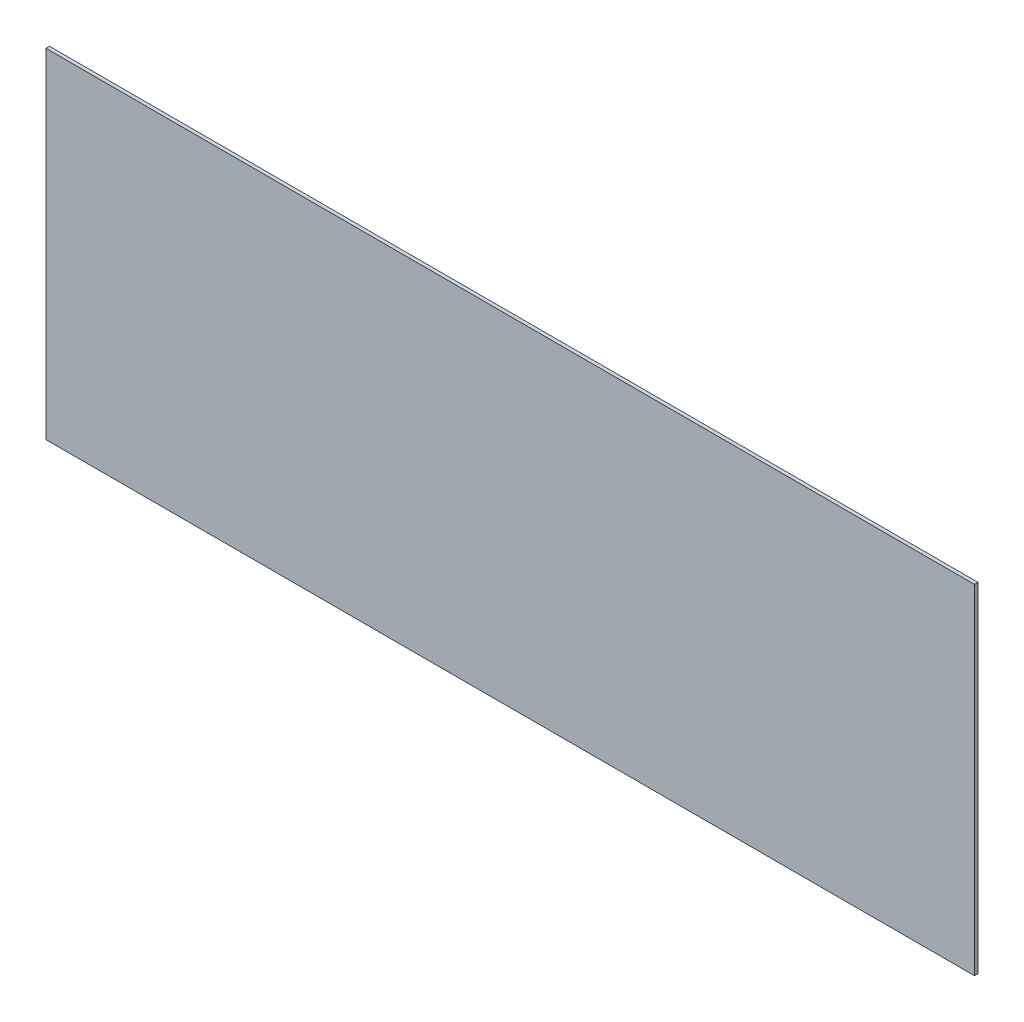
ISO-10303-21;
HEADER;
FILE_DESCRIPTION(('STEP AP214'),'2;1');
FILE_NAME('part.step','',(''),(''),'','','');
FILE_SCHEMA(('AUTOMOTIVE_DESIGN { 1 0 10303 214 1 1 1 1 }'));
ENDSEC;
DATA;
#1=APPLICATION_CONTEXT('core data for automotive mechanical design processes');
#2=APPLICATION_PROTOCOL_DEFINITION('international standard','automotive_design',2000,#1);
#3=PRODUCT_CONTEXT('',#1,'mechanical');
#4=PRODUCT('Part','Part','',(#3));
#5=PRODUCT_RELATED_PRODUCT_CATEGORY('part','',(#4));
#6=PRODUCT_DEFINITION_FORMATION('','',#4);
#7=PRODUCT_DEFINITION_CONTEXT('part definition',#1,'design');
#8=PRODUCT_DEFINITION('design','',#6,#7);
#9=PRODUCT_DEFINITION_SHAPE('','',#8);
#10=(LENGTH_UNIT() NAMED_UNIT(*) SI_UNIT(.MILLI.,.METRE.));
#11=(NAMED_UNIT(*) PLANE_ANGLE_UNIT() SI_UNIT($,.RADIAN.));
#12=(NAMED_UNIT(*) SI_UNIT($,.STERADIAN.) SOLID_ANGLE_UNIT());
#13=UNCERTAINTY_MEASURE_WITH_UNIT(LENGTH_MEASURE(1.E-05),#10,'distance_accuracy_value','');
#14=(GEOMETRIC_REPRESENTATION_CONTEXT(3) GLOBAL_UNCERTAINTY_ASSIGNED_CONTEXT((#13)) GLOBAL_UNIT_ASSIGNED_CONTEXT((#10,
#11,#12)) REPRESENTATION_CONTEXT('',''));
#15=CARTESIAN_POINT('',(0.,0.,0.));
#16=DIRECTION('',(0.,0.,1.));
#17=DIRECTION('',(1.,0.,0.));
#18=AXIS2_PLACEMENT_3D('',#15,#16,#17);
#19=CARTESIAN_POINT('',(-417.5125,-152.4,1.5875));
#20=DIRECTION('',(1.,0.,0.));
#21=DIRECTION('',(0.,1.,0.));
#22=AXIS2_PLACEMENT_3D('',#19,#20,#21);
#23=PLANE('',#22);
#24=DIRECTION('',(0.,-1.,0.));
#25=VECTOR('',#24,1.);
#26=CARTESIAN_POINT('',(-417.5125,-152.4,-1.5875));
#27=LINE('',#26,#25);
#28=CARTESIAN_POINT('',(-417.5125,152.4,-1.5875));
#29=VERTEX_POINT('',#28);
#30=CARTESIAN_POINT('',(-417.5125,-152.4,-1.5875));
#31=VERTEX_POINT('',#30);
#32=EDGE_CURVE('E96',#29,#31,#27,.T.);
#33=ORIENTED_EDGE('',*,*,#32,.T.);
#34=DIRECTION('',(0.,0.,-1.));
#35=VECTOR('',#34,1.);
#36=CARTESIAN_POINT('',(-417.5125,-152.4,1.5875));
#37=LINE('',#36,#35);
#38=CARTESIAN_POINT('',(-417.5125,-152.4,1.5875));
#39=VERTEX_POINT('',#38);
#40=EDGE_CURVE('E11',#39,#31,#37,.T.);
#41=ORIENTED_EDGE('',*,*,#40,.F.);
#42=DIRECTION('',(0.,-1.,0.));
#43=VECTOR('',#42,1.);
#44=CARTESIAN_POINT('',(-417.5125,-152.4,1.5875));
#45=LINE('',#44,#43);
#46=CARTESIAN_POINT('',(-417.5125,152.4,1.5875));
#47=VERTEX_POINT('',#46);
#48=EDGE_CURVE('E84',#47,#39,#45,.T.);
#49=ORIENTED_EDGE('',*,*,#48,.F.);
#50=DIRECTION('',(0.,0.,-1.));
#51=VECTOR('',#50,1.);
#52=CARTESIAN_POINT('',(-417.5125,152.4,1.5875));
#53=LINE('',#52,#51);
#54=EDGE_CURVE('E92',#47,#29,#53,.T.);
#55=ORIENTED_EDGE('',*,*,#54,.T.);
#56=EDGE_LOOP('',(#33,#41,#49,#55));
#57=FACE_BOUND('',#56,.T.);
#58=ADVANCED_FACE('F33',(#57),#23,.F.);
#59=CARTESIAN_POINT('',(417.5125,-152.4,1.5875));
#60=DIRECTION('',(0.,1.,0.));
#61=DIRECTION('',(-1.,0.,0.));
#62=AXIS2_PLACEMENT_3D('',#59,#60,#61);
#63=PLANE('',#62);
#64=DIRECTION('',(1.,0.,0.));
#65=VECTOR('',#64,1.);
#66=CARTESIAN_POINT('',(417.5125,-152.4,-1.5875));
#67=LINE('',#66,#65);
#68=CARTESIAN_POINT('',(417.5125,-152.4,-1.5875));
#69=VERTEX_POINT('',#68);
#70=EDGE_CURVE('E88',#31,#69,#67,.T.);
#71=ORIENTED_EDGE('',*,*,#70,.T.);
#72=DIRECTION('',(0.,0.,-1.));
#73=VECTOR('',#72,1.);
#74=CARTESIAN_POINT('',(417.5125,-152.4,1.5875));
#75=LINE('',#74,#73);
#76=CARTESIAN_POINT('',(417.5125,-152.4,1.5875));
#77=VERTEX_POINT('',#76);
#78=EDGE_CURVE('E41',#77,#69,#75,.T.);
#79=ORIENTED_EDGE('',*,*,#78,.F.);
#80=DIRECTION('',(1.,0.,0.));
#81=VECTOR('',#80,1.);
#82=CARTESIAN_POINT('',(417.5125,-152.4,1.5875));
#83=LINE('',#82,#81);
#84=EDGE_CURVE('E79',#39,#77,#83,.T.);
#85=ORIENTED_EDGE('',*,*,#84,.F.);
#86=ORIENTED_EDGE('',*,*,#40,.T.);
#87=EDGE_LOOP('',(#71,#79,#85,#86));
#88=FACE_BOUND('',#87,.T.);
#89=ADVANCED_FACE('F87',(#88),#63,.F.);
#90=CARTESIAN_POINT('',(417.5125,-152.4,1.5875));
#91=DIRECTION('',(-1.,0.,0.));
#92=DIRECTION('',(0.,0.,1.));
#93=AXIS2_PLACEMENT_3D('',#90,#91,#92);
#94=PLANE('',#93);
#95=DIRECTION('',(0.,1.,0.));
#96=VECTOR('',#95,1.);
#97=CARTESIAN_POINT('',(417.5125,-152.4,-1.5875));
#98=LINE('',#97,#96);
#99=CARTESIAN_POINT('',(417.5125,152.4,-1.5875));
#100=VERTEX_POINT('',#99);
#101=EDGE_CURVE('E66',#69,#100,#98,.T.);
#102=ORIENTED_EDGE('',*,*,#101,.T.);
#103=DIRECTION('',(0.,0.,-1.));
#104=VECTOR('',#103,1.);
#105=CARTESIAN_POINT('',(417.5125,152.4,1.5875));
#106=LINE('',#105,#104);
#107=CARTESIAN_POINT('',(417.5125,152.4,1.5875));
#108=VERTEX_POINT('',#107);
#109=EDGE_CURVE('E89',#108,#100,#106,.T.);
#110=ORIENTED_EDGE('',*,*,#109,.F.);
#111=DIRECTION('',(0.,1.,0.));
#112=VECTOR('',#111,1.);
#113=CARTESIAN_POINT('',(417.5125,-152.4,1.5875));
#114=LINE('',#113,#112);
#115=EDGE_CURVE('E82',#77,#108,#114,.T.);
#116=ORIENTED_EDGE('',*,*,#115,.F.);
#117=ORIENTED_EDGE('',*,*,#78,.T.);
#118=EDGE_LOOP('',(#102,#110,#116,#117));
#119=FACE_BOUND('',#118,.T.);
#120=ADVANCED_FACE('F90',(#119),#94,.F.);
#121=CARTESIAN_POINT('',(417.5125,152.4,1.5875));
#122=DIRECTION('',(0.,-1.,0.));
#123=DIRECTION('',(1.,0.,0.));
#124=AXIS2_PLACEMENT_3D('',#121,#122,#123);
#125=PLANE('',#124);
#126=DIRECTION('',(-1.,0.,0.));
#127=VECTOR('',#126,1.);
#128=CARTESIAN_POINT('',(417.5125,152.4,-1.5875));
#129=LINE('',#128,#127);
#130=EDGE_CURVE('E72',#100,#29,#129,.T.);
#131=ORIENTED_EDGE('',*,*,#130,.T.);
#132=ORIENTED_EDGE('',*,*,#54,.F.);
#133=DIRECTION('',(-1.,0.,0.));
#134=VECTOR('',#133,1.);
#135=CARTESIAN_POINT('',(417.5125,152.4,1.5875));
#136=LINE('',#135,#134);
#137=EDGE_CURVE('E49',#108,#47,#136,.T.);
#138=ORIENTED_EDGE('',*,*,#137,.F.);
#139=ORIENTED_EDGE('',*,*,#109,.T.);
#140=EDGE_LOOP('',(#131,#132,#138,#139));
#141=FACE_BOUND('',#140,.T.);
#142=ADVANCED_FACE('F103',(#141),#125,.F.);
#143=CARTESIAN_POINT('',(0.,0.,1.5875));
#144=DIRECTION('',(0.,0.,1.));
#145=DIRECTION('',(1.,0.,0.));
#146=AXIS2_PLACEMENT_3D('',#143,#144,#145);
#147=PLANE('',#146);
#148=ORIENTED_EDGE('',*,*,#48,.T.);
#149=ORIENTED_EDGE('',*,*,#84,.T.);
#150=ORIENTED_EDGE('',*,*,#115,.T.);
#151=ORIENTED_EDGE('',*,*,#137,.T.);
#152=EDGE_LOOP('',(#148,#149,#150,#151));
#153=FACE_BOUND('',#152,.T.);
#154=ADVANCED_FACE('F80',(#153),#147,.T.);
#155=CARTESIAN_POINT('',(0.,0.,-1.5875));
#156=DIRECTION('',(0.,0.,1.));
#157=DIRECTION('',(1.,0.,0.));
#158=AXIS2_PLACEMENT_3D('',#155,#156,#157);
#159=PLANE('',#158);
#160=ORIENTED_EDGE('',*,*,#32,.F.);
#161=ORIENTED_EDGE('',*,*,#130,.F.);
#162=ORIENTED_EDGE('',*,*,#101,.F.);
#163=ORIENTED_EDGE('',*,*,#70,.F.);
#164=EDGE_LOOP('',(#160,#161,#162,#163));
#165=FACE_BOUND('',#164,.T.);
#166=ADVANCED_FACE('F106',(#165),#159,.F.);
#167=CLOSED_SHELL('',(#58,#89,#120,#142,#154,#166));
#168=MANIFOLD_SOLID_BREP('B2',#167);
#169=ADVANCED_BREP_SHAPE_REPRESENTATION('',(#18,#168),#14);
#170=SHAPE_DEFINITION_REPRESENTATION(#9,#169);
ENDSEC;
END-ISO-10303-21;
